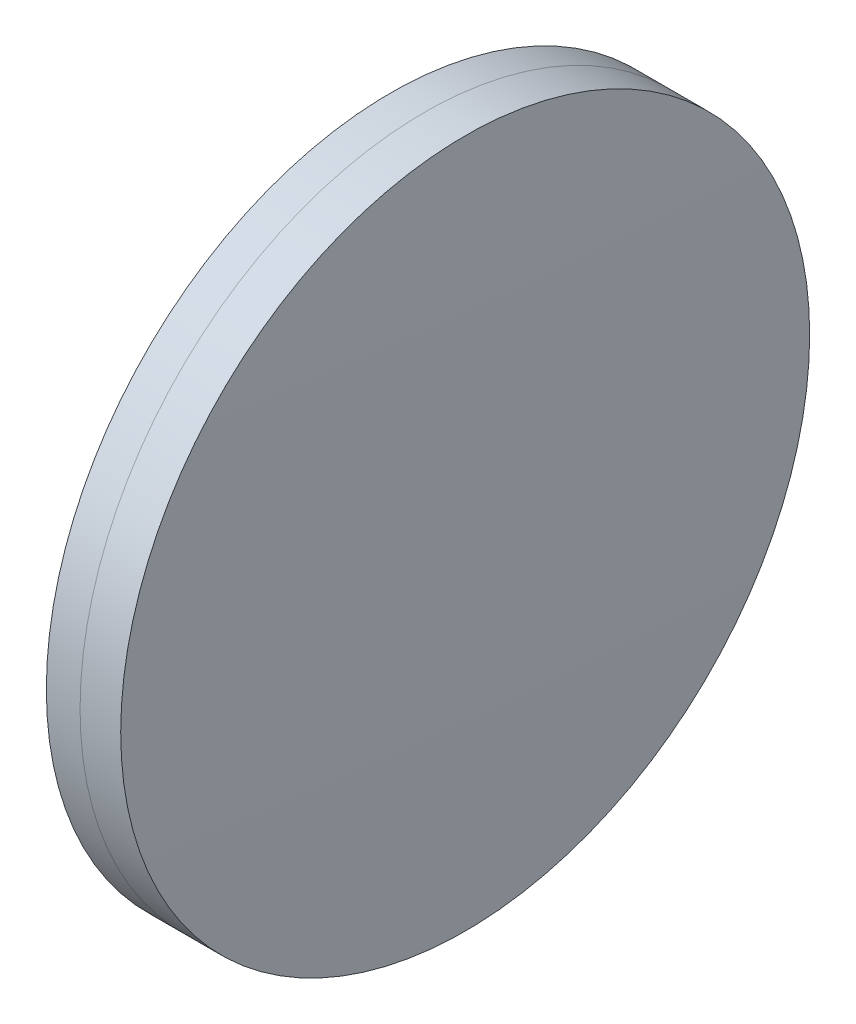
ISO-10303-21;
HEADER;
FILE_DESCRIPTION(('STEP AP214'),'2;1');
FILE_NAME('part.step','',(''),(''),'','','');
FILE_SCHEMA(('AUTOMOTIVE_DESIGN { 1 0 10303 214 1 1 1 1 }'));
ENDSEC;
DATA;
#1=APPLICATION_CONTEXT('core data for automotive mechanical design processes');
#2=APPLICATION_PROTOCOL_DEFINITION('international standard','automotive_design',2000,#1);
#3=PRODUCT_CONTEXT('',#1,'mechanical');
#4=PRODUCT('Part','Part','',(#3));
#5=PRODUCT_RELATED_PRODUCT_CATEGORY('part','',(#4));
#6=PRODUCT_DEFINITION_FORMATION('','',#4);
#7=PRODUCT_DEFINITION_CONTEXT('part definition',#1,'design');
#8=PRODUCT_DEFINITION('design','',#6,#7);
#9=PRODUCT_DEFINITION_SHAPE('','',#8);
#10=(LENGTH_UNIT() NAMED_UNIT(*) SI_UNIT(.MILLI.,.METRE.));
#11=(NAMED_UNIT(*) PLANE_ANGLE_UNIT() SI_UNIT($,.RADIAN.));
#12=(NAMED_UNIT(*) SI_UNIT($,.STERADIAN.) SOLID_ANGLE_UNIT());
#13=UNCERTAINTY_MEASURE_WITH_UNIT(LENGTH_MEASURE(1.E-05),#10,'distance_accuracy_value','');
#14=(GEOMETRIC_REPRESENTATION_CONTEXT(3) GLOBAL_UNCERTAINTY_ASSIGNED_CONTEXT((#13)) GLOBAL_UNIT_ASSIGNED_CONTEXT((#10,
#11,#12)) REPRESENTATION_CONTEXT('',''));
#15=CARTESIAN_POINT('',(0.,0.,0.));
#16=DIRECTION('',(0.,0.,1.));
#17=DIRECTION('',(1.,0.,0.));
#18=AXIS2_PLACEMENT_3D('',#15,#16,#17);
#19=CARTESIAN_POINT('',(257.621782443091,0.,0.));
#20=DIRECTION('',(-1.,0.,0.));
#21=DIRECTION('',(0.,0.,1.));
#22=AXIS2_PLACEMENT_3D('',#19,#20,#21);
#23=SPHERICAL_SURFACE('',#22,243.3);
#24=CARTESIAN_POINT('',(499.592297175775,0.,0.));
#25=DIRECTION('',(-1.,0.,0.));
#26=DIRECTION('',(0.,0.,1.));
#27=AXIS2_PLACEMENT_3D('',#24,#25,#26);
#28=CIRCLE('',#27,25.3999999999997);
#29=CARTESIAN_POINT('',(499.592297175775,0.,25.3999999999997));
#30=VERTEX_POINT('',#29);
#31=EDGE_CURVE('E11',#30,#30,#28,.T.);
#32=ORIENTED_EDGE('',*,*,#31,.T.);
#33=EDGE_LOOP('',(#32));
#34=FACE_BOUND('',#33,.T.);
#35=ADVANCED_FACE('F45',(#34),#23,.F.);
#36=CARTESIAN_POINT('',(-0.551919992657797,0.,0.));
#37=DIRECTION('',(-1.,0.,0.));
#38=DIRECTION('',(0.,0.,1.));
#39=AXIS2_PLACEMENT_3D('',#36,#37,#38);
#40=CYLINDRICAL_SURFACE('',#39,25.3999999999997);
#41=CARTESIAN_POINT('',(502.589168715312,0.,0.));
#42=DIRECTION('',(-1.,0.,0.));
#43=DIRECTION('',(0.,0.,1.));
#44=AXIS2_PLACEMENT_3D('',#41,#42,#43);
#45=CIRCLE('',#44,25.3999999999996);
#46=CARTESIAN_POINT('',(502.589168715312,0.,25.3999999999996));
#47=VERTEX_POINT('',#46);
#48=EDGE_CURVE('E51',#47,#47,#45,.T.);
#49=ORIENTED_EDGE('',*,*,#48,.T.);
#50=EDGE_LOOP('',(#49));
#51=FACE_BOUND('',#50,.T.);
#52=ORIENTED_EDGE('',*,*,#31,.F.);
#53=EDGE_LOOP('',(#52));
#54=FACE_BOUND('',#53,.T.);
#55=ADVANCED_FACE('F57',(#51,#54),#40,.T.);
#56=CARTESIAN_POINT('',(-467.078217556909,0.,0.));
#57=DIRECTION('',(-1.,0.,0.));
#58=DIRECTION('',(0.,0.,1.));
#59=AXIS2_PLACEMENT_3D('',#56,#57,#58);
#60=SPHERICAL_SURFACE('',#59,970.);
#61=ORIENTED_EDGE('',*,*,#48,.F.);
#62=EDGE_LOOP('',(#61));
#63=FACE_BOUND('',#62,.T.);
#64=ADVANCED_FACE('F60',(#63),#60,.T.);
#65=CLOSED_SHELL('',(#35,#55,#64));
#66=MANIFOLD_SOLID_BREP('B2',#65);
#67=CARTESIAN_POINT('',(768.821782443091,0.,0.));
#68=DIRECTION('',(-1.,0.,0.));
#69=DIRECTION('',(0.,0.,-1.));
#70=AXIS2_PLACEMENT_3D('',#67,#68,#69);
#71=SPHERICAL_SURFACE('',#70,272.9);
#72=CARTESIAN_POINT('',(497.106398263248,0.,0.));
#73=DIRECTION('',(-1.,0.,0.));
#74=DIRECTION('',(0.,0.,1.));
#75=AXIS2_PLACEMENT_3D('',#72,#73,#74);
#76=CIRCLE('',#75,25.4);
#77=CARTESIAN_POINT('',(497.106398263248,0.,25.4));
#78=VERTEX_POINT('',#77);
#79=EDGE_CURVE('E44',#78,#78,#76,.T.);
#80=ORIENTED_EDGE('',*,*,#79,.T.);
#81=EDGE_LOOP('',(#80));
#82=FACE_BOUND('',#81,.T.);
#83=ADVANCED_FACE('F86',(#82),#71,.T.);
#84=CARTESIAN_POINT('',(124.523309526045,0.,0.));
#85=DIRECTION('',(-1.,0.,0.));
#86=DIRECTION('',(0.,0.,1.));
#87=AXIS2_PLACEMENT_3D('',#84,#85,#86);
#88=CYLINDRICAL_SURFACE('',#87,25.4);
#89=CARTESIAN_POINT('',(499.592297175775,0.,0.));
#90=DIRECTION('',(-1.,0.,0.));
#91=DIRECTION('',(0.,0.,1.));
#92=AXIS2_PLACEMENT_3D('',#89,#90,#91);
#93=CIRCLE('',#92,25.4);
#94=CARTESIAN_POINT('',(499.592297175775,0.,25.4));
#95=VERTEX_POINT('',#94);
#96=EDGE_CURVE('E92',#95,#95,#93,.T.);
#97=ORIENTED_EDGE('',*,*,#96,.T.);
#98=EDGE_LOOP('',(#97));
#99=FACE_BOUND('',#98,.T.);
#100=ORIENTED_EDGE('',*,*,#79,.F.);
#101=EDGE_LOOP('',(#100));
#102=FACE_BOUND('',#101,.T.);
#103=ADVANCED_FACE('F98',(#99,#102),#88,.T.);
#104=CARTESIAN_POINT('',(257.621782443091,0.,0.));
#105=DIRECTION('',(-1.,0.,0.));
#106=DIRECTION('',(0.,0.,1.));
#107=AXIS2_PLACEMENT_3D('',#104,#105,#106);
#108=SPHERICAL_SURFACE('',#107,243.3);
#109=ORIENTED_EDGE('',*,*,#96,.F.);
#110=EDGE_LOOP('',(#109));
#111=FACE_BOUND('',#110,.T.);
#112=ADVANCED_FACE('F101',(#111),#108,.T.);
#113=CLOSED_SHELL('',(#83,#103,#112));
#114=MANIFOLD_SOLID_BREP('B6',#113);
#115=ADVANCED_BREP_SHAPE_REPRESENTATION('',(#18,#66,#114),#14);
#116=SHAPE_DEFINITION_REPRESENTATION(#9,#115);
ENDSEC;
END-ISO-10303-21;
